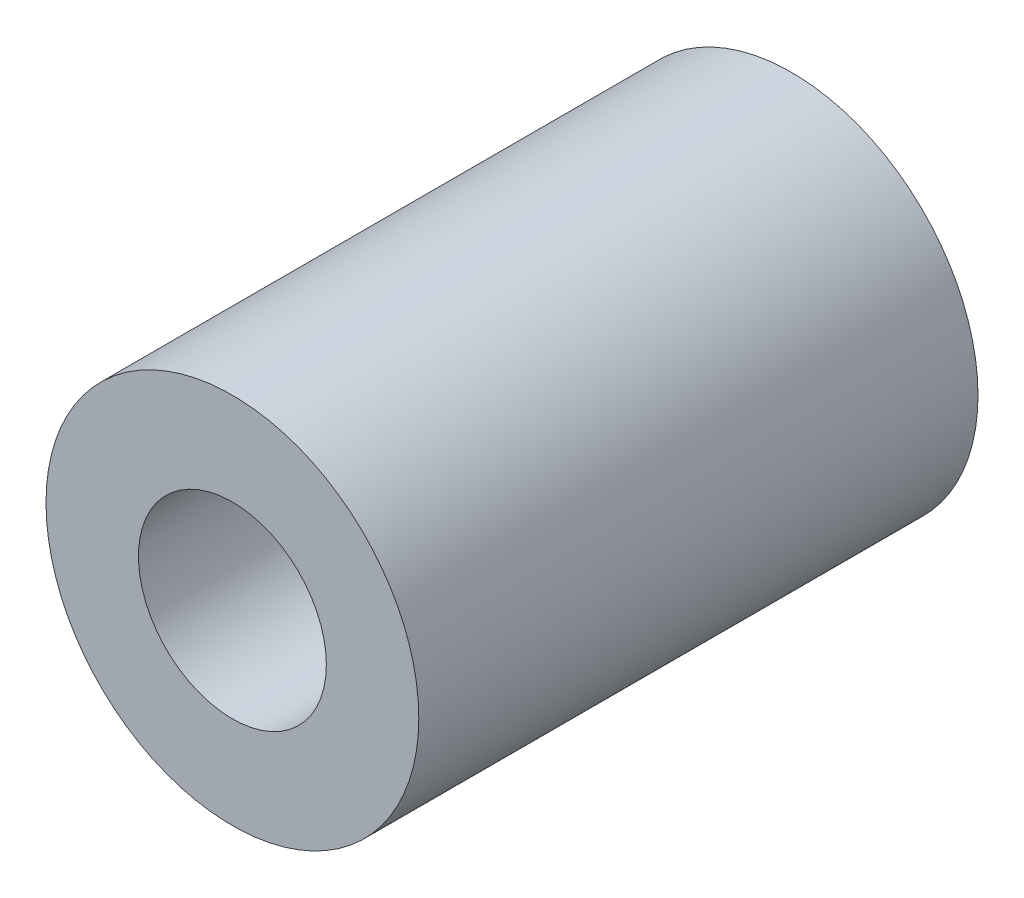
ISO-10303-21;
HEADER;
FILE_DESCRIPTION(('STEP AP214'),'2;1');
FILE_NAME('part.step','',(''),(''),'','','');
FILE_SCHEMA(('AUTOMOTIVE_DESIGN { 1 0 10303 214 1 1 1 1 }'));
ENDSEC;
DATA;
#1=APPLICATION_CONTEXT('core data for automotive mechanical design processes');
#2=APPLICATION_PROTOCOL_DEFINITION('international standard','automotive_design',2000,#1);
#3=PRODUCT_CONTEXT('',#1,'mechanical');
#4=PRODUCT('Part','Part','',(#3));
#5=PRODUCT_RELATED_PRODUCT_CATEGORY('part','',(#4));
#6=PRODUCT_DEFINITION_FORMATION('','',#4);
#7=PRODUCT_DEFINITION_CONTEXT('part definition',#1,'design');
#8=PRODUCT_DEFINITION('design','',#6,#7);
#9=PRODUCT_DEFINITION_SHAPE('','',#8);
#10=(LENGTH_UNIT() NAMED_UNIT(*) SI_UNIT(.MILLI.,.METRE.));
#11=(NAMED_UNIT(*) PLANE_ANGLE_UNIT() SI_UNIT($,.RADIAN.));
#12=(NAMED_UNIT(*) SI_UNIT($,.STERADIAN.) SOLID_ANGLE_UNIT());
#13=UNCERTAINTY_MEASURE_WITH_UNIT(LENGTH_MEASURE(1.E-05),#10,'distance_accuracy_value','');
#14=(GEOMETRIC_REPRESENTATION_CONTEXT(3) GLOBAL_UNCERTAINTY_ASSIGNED_CONTEXT((#13)) GLOBAL_UNIT_ASSIGNED_CONTEXT((#10,
#11,#12)) REPRESENTATION_CONTEXT('',''));
#15=CARTESIAN_POINT('',(0.,0.,0.));
#16=DIRECTION('',(0.,0.,1.));
#17=DIRECTION('',(1.,0.,0.));
#18=AXIS2_PLACEMENT_3D('',#15,#16,#17);
#19=CARTESIAN_POINT('',(0.,0.,9.525));
#20=DIRECTION('',(0.,0.,1.));
#21=DIRECTION('',(1.,0.,0.));
#22=AXIS2_PLACEMENT_3D('',#19,#20,#21);
#23=PLANE('',#22);
#24=CARTESIAN_POINT('',(0.,0.,9.525));
#25=DIRECTION('',(0.,0.,1.));
#26=DIRECTION('',(1.,0.,0.));
#27=AXIS2_PLACEMENT_3D('',#24,#25,#26);
#28=CIRCLE('',#27,6.35);
#29=CARTESIAN_POINT('',(6.35,0.,9.525));
#30=VERTEX_POINT('',#29);
#31=EDGE_CURVE('E10',#30,#30,#28,.T.);
#32=ORIENTED_EDGE('',*,*,#31,.T.);
#33=EDGE_LOOP('',(#32));
#34=FACE_BOUND('',#33,.T.);
#35=CARTESIAN_POINT('',(0.,0.,9.525));
#36=DIRECTION('',(0.,0.,1.));
#37=DIRECTION('',(1.,0.,0.));
#38=AXIS2_PLACEMENT_3D('',#35,#36,#37);
#39=CIRCLE('',#38,3.2004);
#40=CARTESIAN_POINT('',(3.2004,0.,9.525));
#41=VERTEX_POINT('',#40);
#42=EDGE_CURVE('E39',#41,#41,#39,.T.);
#43=ORIENTED_EDGE('',*,*,#42,.F.);
#44=EDGE_LOOP('',(#43));
#45=FACE_BOUND('',#44,.T.);
#46=ADVANCED_FACE('F32',(#34,#45),#23,.T.);
#47=CARTESIAN_POINT('',(0.,0.,9.525));
#48=DIRECTION('',(0.,0.,-1.));
#49=DIRECTION('',(-1.,0.,0.));
#50=AXIS2_PLACEMENT_3D('',#47,#48,#49);
#51=CYLINDRICAL_SURFACE('',#50,6.35);
#52=ORIENTED_EDGE('',*,*,#31,.F.);
#53=EDGE_LOOP('',(#52));
#54=FACE_BOUND('',#53,.T.);
#55=CARTESIAN_POINT('',(0.,0.,-9.525));
#56=DIRECTION('',(0.,0.,1.));
#57=DIRECTION('',(1.,0.,0.));
#58=AXIS2_PLACEMENT_3D('',#55,#56,#57);
#59=CIRCLE('',#58,6.35);
#60=CARTESIAN_POINT('',(6.35,0.,-9.525));
#61=VERTEX_POINT('',#60);
#62=EDGE_CURVE('E43',#61,#61,#59,.T.);
#63=ORIENTED_EDGE('',*,*,#62,.T.);
#64=EDGE_LOOP('',(#63));
#65=FACE_BOUND('',#64,.T.);
#66=ADVANCED_FACE('F34',(#54,#65),#51,.T.);
#67=CARTESIAN_POINT('',(0.,0.,9.525));
#68=DIRECTION('',(0.,0.,-1.));
#69=DIRECTION('',(-1.,0.,0.));
#70=AXIS2_PLACEMENT_3D('',#67,#68,#69);
#71=CYLINDRICAL_SURFACE('',#70,3.2004);
#72=ORIENTED_EDGE('',*,*,#42,.T.);
#73=EDGE_LOOP('',(#72));
#74=FACE_BOUND('',#73,.T.);
#75=CARTESIAN_POINT('',(0.,0.,-9.525));
#76=DIRECTION('',(0.,0.,1.));
#77=DIRECTION('',(1.,0.,0.));
#78=AXIS2_PLACEMENT_3D('',#75,#76,#77);
#79=CIRCLE('',#78,3.2004);
#80=CARTESIAN_POINT('',(3.2004,0.,-9.525));
#81=VERTEX_POINT('',#80);
#82=EDGE_CURVE('E47',#81,#81,#79,.T.);
#83=ORIENTED_EDGE('',*,*,#82,.F.);
#84=EDGE_LOOP('',(#83));
#85=FACE_BOUND('',#84,.T.);
#86=ADVANCED_FACE('F56',(#74,#85),#71,.F.);
#87=CARTESIAN_POINT('',(0.,0.,-9.525));
#88=DIRECTION('',(0.,0.,1.));
#89=DIRECTION('',(1.,0.,0.));
#90=AXIS2_PLACEMENT_3D('',#87,#88,#89);
#91=PLANE('',#90);
#92=ORIENTED_EDGE('',*,*,#82,.T.);
#93=EDGE_LOOP('',(#92));
#94=FACE_BOUND('',#93,.T.);
#95=ORIENTED_EDGE('',*,*,#62,.F.);
#96=EDGE_LOOP('',(#95));
#97=FACE_BOUND('',#96,.T.);
#98=ADVANCED_FACE('F53',(#94,#97),#91,.F.);
#99=CLOSED_SHELL('',(#46,#66,#86,#98));
#100=MANIFOLD_SOLID_BREP('B2',#99);
#101=ADVANCED_BREP_SHAPE_REPRESENTATION('',(#18,#100),#14);
#102=SHAPE_DEFINITION_REPRESENTATION(#9,#101);
ENDSEC;
END-ISO-10303-21;
